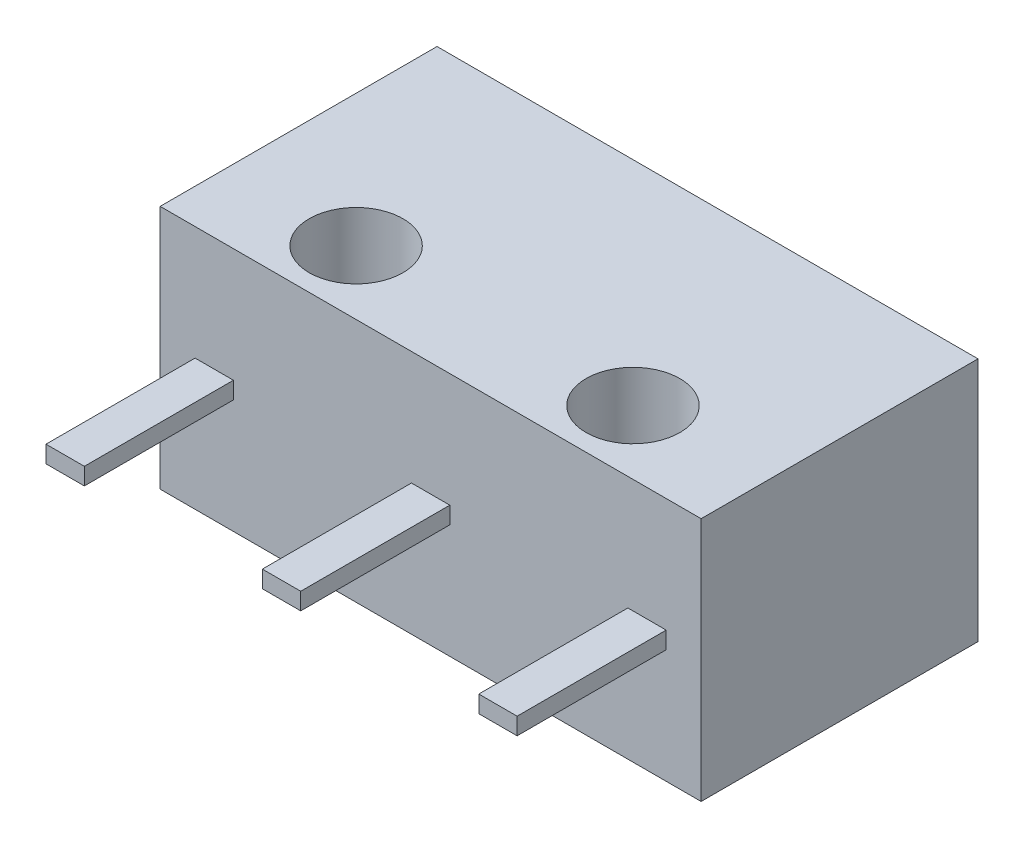
ISO-10303-21;
HEADER;
FILE_DESCRIPTION(('STEP AP214'),'2;1');
FILE_NAME('part.step','',(''),(''),'','','');
FILE_SCHEMA(('AUTOMOTIVE_DESIGN { 1 0 10303 214 1 1 1 1 }'));
ENDSEC;
DATA;
#1=APPLICATION_CONTEXT('core data for automotive mechanical design processes');
#2=APPLICATION_PROTOCOL_DEFINITION('international standard','automotive_design',2000,#1);
#3=PRODUCT_CONTEXT('',#1,'mechanical');
#4=PRODUCT('Part','Part','',(#3));
#5=PRODUCT_RELATED_PRODUCT_CATEGORY('part','',(#4));
#6=PRODUCT_DEFINITION_FORMATION('','',#4);
#7=PRODUCT_DEFINITION_CONTEXT('part definition',#1,'design');
#8=PRODUCT_DEFINITION('design','',#6,#7);
#9=PRODUCT_DEFINITION_SHAPE('','',#8);
#10=(LENGTH_UNIT() NAMED_UNIT(*) SI_UNIT(.MILLI.,.METRE.));
#11=(NAMED_UNIT(*) PLANE_ANGLE_UNIT() SI_UNIT($,.RADIAN.));
#12=(NAMED_UNIT(*) SI_UNIT($,.STERADIAN.) SOLID_ANGLE_UNIT());
#13=UNCERTAINTY_MEASURE_WITH_UNIT(LENGTH_MEASURE(1.E-05),#10,'distance_accuracy_value','');
#14=(GEOMETRIC_REPRESENTATION_CONTEXT(3) GLOBAL_UNCERTAINTY_ASSIGNED_CONTEXT((#13)) GLOBAL_UNIT_ASSIGNED_CONTEXT((#10,
#11,#12)) REPRESENTATION_CONTEXT('',''));
#15=CARTESIAN_POINT('',(0.,0.,0.));
#16=DIRECTION('',(0.,0.,1.));
#17=DIRECTION('',(1.,0.,0.));
#18=AXIS2_PLACEMENT_3D('',#15,#16,#17);
#19=CARTESIAN_POINT('',(5.9,2.675,3.5));
#20=DIRECTION('',(-1.,0.,0.));
#21=DIRECTION('',(0.,0.,1.));
#22=AXIS2_PLACEMENT_3D('',#19,#20,#21);
#23=PLANE('',#22);
#24=DIRECTION('',(0.,1.,0.));
#25=VECTOR('',#24,1.);
#26=CARTESIAN_POINT('',(5.9,2.675,0.));
#27=LINE('',#26,#25);
#28=CARTESIAN_POINT('',(5.9,3.075,0.));
#29=VERTEX_POINT('',#28);
#30=CARTESIAN_POINT('',(5.9,2.675,0.));
#31=VERTEX_POINT('',#30);
#32=EDGE_CURVE('E172',#29,#31,#27,.F.);
#33=ORIENTED_EDGE('',*,*,#32,.T.);
#34=DIRECTION('',(0.,0.,-1.));
#35=VECTOR('',#34,1.);
#36=CARTESIAN_POINT('',(5.9,2.675,0.));
#37=LINE('',#36,#35);
#38=CARTESIAN_POINT('',(5.9,2.675,3.5));
#39=VERTEX_POINT('',#38);
#40=EDGE_CURVE('E233',#39,#31,#37,.T.);
#41=ORIENTED_EDGE('',*,*,#40,.F.);
#42=DIRECTION('',(0.,1.,0.));
#43=VECTOR('',#42,1.);
#44=CARTESIAN_POINT('',(5.9,2.675,3.5));
#45=LINE('',#44,#43);
#46=CARTESIAN_POINT('',(5.9,3.075,3.5));
#47=VERTEX_POINT('',#46);
#48=EDGE_CURVE('E236',#47,#39,#45,.F.);
#49=ORIENTED_EDGE('',*,*,#48,.F.);
#50=DIRECTION('',(0.,0.,-1.));
#51=VECTOR('',#50,1.);
#52=CARTESIAN_POINT('',(5.9,3.075,0.));
#53=LINE('',#52,#51);
#54=EDGE_CURVE('E241',#47,#29,#53,.T.);
#55=ORIENTED_EDGE('',*,*,#54,.T.);
#56=EDGE_LOOP('',(#33,#41,#49,#55));
#57=FACE_BOUND('',#56,.T.);
#58=ADVANCED_FACE('F17',(#57),#23,.T.);
#59=CARTESIAN_POINT('',(10.98,2.675,3.5));
#60=DIRECTION('',(-1.,0.,0.));
#61=DIRECTION('',(0.,0.,1.));
#62=AXIS2_PLACEMENT_3D('',#59,#60,#61);
#63=PLANE('',#62);
#64=DIRECTION('',(0.,1.,0.));
#65=VECTOR('',#64,1.);
#66=CARTESIAN_POINT('',(10.98,2.675,0.));
#67=LINE('',#66,#65);
#68=CARTESIAN_POINT('',(10.98,3.075,0.));
#69=VERTEX_POINT('',#68);
#70=CARTESIAN_POINT('',(10.98,2.675,0.));
#71=VERTEX_POINT('',#70);
#72=EDGE_CURVE('E170',#69,#71,#67,.F.);
#73=ORIENTED_EDGE('',*,*,#72,.T.);
#74=DIRECTION('',(0.,0.,-1.));
#75=VECTOR('',#74,1.);
#76=CARTESIAN_POINT('',(10.98,2.675,0.));
#77=LINE('',#76,#75);
#78=CARTESIAN_POINT('',(10.98,2.675,3.5));
#79=VERTEX_POINT('',#78);
#80=EDGE_CURVE('E212',#79,#71,#77,.T.);
#81=ORIENTED_EDGE('',*,*,#80,.F.);
#82=DIRECTION('',(0.,1.,0.));
#83=VECTOR('',#82,1.);
#84=CARTESIAN_POINT('',(10.98,2.675,3.5));
#85=LINE('',#84,#83);
#86=CARTESIAN_POINT('',(10.98,3.075,3.5));
#87=VERTEX_POINT('',#86);
#88=EDGE_CURVE('E218',#87,#79,#85,.F.);
#89=ORIENTED_EDGE('',*,*,#88,.F.);
#90=DIRECTION('',(0.,0.,-1.));
#91=VECTOR('',#90,1.);
#92=CARTESIAN_POINT('',(10.98,3.075,0.));
#93=LINE('',#92,#91);
#94=EDGE_CURVE('E225',#87,#69,#93,.T.);
#95=ORIENTED_EDGE('',*,*,#94,.T.);
#96=EDGE_LOOP('',(#73,#81,#89,#95));
#97=FACE_BOUND('',#96,.T.);
#98=ADVANCED_FACE('F424',(#97),#63,.T.);
#99=CARTESIAN_POINT('',(0.,3.075,0.));
#100=DIRECTION('',(0.,1.,0.));
#101=DIRECTION('',(0.,0.,1.));
#102=AXIS2_PLACEMENT_3D('',#99,#100,#101);
#103=PLANE('',#102);
#104=DIRECTION('',(0.,0.,-1.));
#105=VECTOR('',#104,1.);
#106=CARTESIAN_POINT('',(1.72,3.075,3.5));
#107=LINE('',#106,#105);
#108=CARTESIAN_POINT('',(1.72,3.075,0.));
#109=VERTEX_POINT('',#108);
#110=CARTESIAN_POINT('',(1.72,3.075,3.5));
#111=VERTEX_POINT('',#110);
#112=EDGE_CURVE('E204',#109,#111,#107,.F.);
#113=ORIENTED_EDGE('',*,*,#112,.F.);
#114=DIRECTION('',(1.,0.,0.));
#115=VECTOR('',#114,1.);
#116=CARTESIAN_POINT('',(0.,3.075,0.));
#117=LINE('',#116,#115);
#118=CARTESIAN_POINT('',(0.820000000000001,3.075,0.));
#119=VERTEX_POINT('',#118);
#120=EDGE_CURVE('E147',#109,#119,#117,.F.);
#121=ORIENTED_EDGE('',*,*,#120,.T.);
#122=DIRECTION('',(0.,0.,1.));
#123=VECTOR('',#122,1.);
#124=CARTESIAN_POINT('',(0.820000000000001,3.075,0.));
#125=LINE('',#124,#123);
#126=CARTESIAN_POINT('',(0.820000000000001,3.075,3.5));
#127=VERTEX_POINT('',#126);
#128=EDGE_CURVE('E196',#127,#119,#125,.F.);
#129=ORIENTED_EDGE('',*,*,#128,.F.);
#130=DIRECTION('',(1.,0.,0.));
#131=VECTOR('',#130,1.);
#132=CARTESIAN_POINT('',(1.27,3.075,3.5));
#133=LINE('',#132,#131);
#134=EDGE_CURVE('E208',#111,#127,#133,.F.);
#135=ORIENTED_EDGE('',*,*,#134,.F.);
#136=EDGE_LOOP('',(#113,#121,#129,#135));
#137=FACE_BOUND('',#136,.T.);
#138=ADVANCED_FACE('F260',(#137),#103,.T.);
#139=CARTESIAN_POINT('',(4.4,4.325,-6.5));
#140=DIRECTION('',(0.,-1.,0.));
#141=DIRECTION('',(0.,0.,-1.));
#142=AXIS2_PLACEMENT_3D('',#139,#140,#141);
#143=PLANE('',#142);
#144=DIRECTION('',(1.,0.,0.));
#145=VECTOR('',#144,1.);
#146=CARTESIAN_POINT('',(4.4,4.325,-6.5));
#147=LINE('',#146,#145);
#148=CARTESIAN_POINT('',(5.,4.325,-6.5));
#149=VERTEX_POINT('',#148);
#150=CARTESIAN_POINT('',(3.8,4.325,-6.5));
#151=VERTEX_POINT('',#150);
#152=EDGE_CURVE('E140',#149,#151,#147,.F.);
#153=ORIENTED_EDGE('',*,*,#152,.F.);
#154=CARTESIAN_POINT('',(4.4,4.325,-6.5));
#155=DIRECTION('',(0.,1.,0.));
#156=DIRECTION('',(0.,0.,1.));
#157=AXIS2_PLACEMENT_3D('',#154,#155,#156);
#158=CIRCLE('',#157,0.6);
#159=EDGE_CURVE('E20',#151,#149,#158,.F.);
#160=ORIENTED_EDGE('',*,*,#159,.F.);
#161=EDGE_LOOP('',(#153,#160));
#162=FACE_BOUND('',#161,.T.);
#163=ADVANCED_FACE('F144',(#162),#143,.F.);
#164=CARTESIAN_POINT('',(4.4,1.425,-6.5));
#165=DIRECTION('',(0.,-1.,0.));
#166=DIRECTION('',(0.,0.,-1.));
#167=AXIS2_PLACEMENT_3D('',#164,#165,#166);
#168=PLANE('',#167);
#169=CARTESIAN_POINT('',(4.4,1.425,-6.5));
#170=DIRECTION('',(0.,1.,0.));
#171=DIRECTION('',(0.,0.,1.));
#172=AXIS2_PLACEMENT_3D('',#169,#170,#171);
#173=CIRCLE('',#172,0.6);
#174=CARTESIAN_POINT('',(5.,1.425,-6.5));
#175=VERTEX_POINT('',#174);
#176=CARTESIAN_POINT('',(3.8,1.425,-6.5));
#177=VERTEX_POINT('',#176);
#178=EDGE_CURVE('E155',#175,#177,#173,.T.);
#179=ORIENTED_EDGE('',*,*,#178,.F.);
#180=DIRECTION('',(1.,0.,0.));
#181=VECTOR('',#180,1.);
#182=CARTESIAN_POINT('',(4.4,1.425,-6.5));
#183=LINE('',#182,#181);
#184=EDGE_CURVE('E146',#175,#177,#183,.F.);
#185=ORIENTED_EDGE('',*,*,#184,.T.);
#186=EDGE_LOOP('',(#179,#185));
#187=FACE_BOUND('',#186,.T.);
#188=ADVANCED_FACE('F248',(#187),#168,.T.);
#189=CARTESIAN_POINT('',(0.,3.075,0.));
#190=DIRECTION('',(0.,-1.,0.));
#191=DIRECTION('',(0.,0.,-1.));
#192=AXIS2_PLACEMENT_3D('',#189,#190,#191);
#193=PLANE('',#192);
#194=DIRECTION('',(1.,0.,0.));
#195=VECTOR('',#194,1.);
#196=CARTESIAN_POINT('',(5.9,3.075,3.5));
#197=LINE('',#196,#195);
#198=CARTESIAN_POINT('',(6.8,3.075,3.5));
#199=VERTEX_POINT('',#198);
#200=EDGE_CURVE('E238',#199,#47,#197,.F.);
#201=ORIENTED_EDGE('',*,*,#200,.F.);
#202=DIRECTION('',(0.,0.,-1.));
#203=VECTOR('',#202,1.);
#204=CARTESIAN_POINT('',(6.8,3.075,3.5));
#205=LINE('',#204,#203);
#206=CARTESIAN_POINT('',(6.8,3.075,0.));
#207=VERTEX_POINT('',#206);
#208=EDGE_CURVE('E184',#207,#199,#205,.F.);
#209=ORIENTED_EDGE('',*,*,#208,.F.);
#210=DIRECTION('',(1.,0.,0.));
#211=VECTOR('',#210,1.);
#212=CARTESIAN_POINT('',(0.,3.075,0.));
#213=LINE('',#212,#211);
#214=EDGE_CURVE('E243',#29,#207,#213,.T.);
#215=ORIENTED_EDGE('',*,*,#214,.F.);
#216=ORIENTED_EDGE('',*,*,#54,.F.);
#217=EDGE_LOOP('',(#201,#209,#215,#216));
#218=FACE_BOUND('',#217,.T.);
#219=ADVANCED_FACE('F250',(#218),#193,.F.);
#220=CARTESIAN_POINT('',(5.9,2.675,3.5));
#221=DIRECTION('',(0.,0.,1.));
#222=DIRECTION('',(1.,0.,0.));
#223=AXIS2_PLACEMENT_3D('',#220,#221,#222);
#224=PLANE('',#223);
#225=ORIENTED_EDGE('',*,*,#48,.T.);
#226=DIRECTION('',(1.,0.,0.));
#227=VECTOR('',#226,1.);
#228=CARTESIAN_POINT('',(0.,2.675,3.5));
#229=LINE('',#228,#227);
#230=CARTESIAN_POINT('',(6.8,2.675,3.5));
#231=VERTEX_POINT('',#230);
#232=EDGE_CURVE('E228',#231,#39,#229,.F.);
#233=ORIENTED_EDGE('',*,*,#232,.F.);
#234=DIRECTION('',(0.,1.,0.));
#235=VECTOR('',#234,1.);
#236=CARTESIAN_POINT('',(6.8,2.675,3.5));
#237=LINE('',#236,#235);
#238=EDGE_CURVE('E185',#199,#231,#237,.F.);
#239=ORIENTED_EDGE('',*,*,#238,.F.);
#240=ORIENTED_EDGE('',*,*,#200,.T.);
#241=EDGE_LOOP('',(#225,#233,#239,#240));
#242=FACE_BOUND('',#241,.T.);
#243=ADVANCED_FACE('F257',(#242),#224,.T.);
#244=CARTESIAN_POINT('',(0.,2.675,0.));
#245=DIRECTION('',(0.,-1.,0.));
#246=DIRECTION('',(0.,0.,-1.));
#247=AXIS2_PLACEMENT_3D('',#244,#245,#246);
#248=PLANE('',#247);
#249=DIRECTION('',(0.,0.,-1.));
#250=VECTOR('',#249,1.);
#251=CARTESIAN_POINT('',(6.8,2.675,3.5));
#252=LINE('',#251,#250);
#253=CARTESIAN_POINT('',(6.8,2.675,0.));
#254=VERTEX_POINT('',#253);
#255=EDGE_CURVE('E191',#231,#254,#252,.T.);
#256=ORIENTED_EDGE('',*,*,#255,.F.);
#257=ORIENTED_EDGE('',*,*,#232,.T.);
#258=ORIENTED_EDGE('',*,*,#40,.T.);
#259=DIRECTION('',(1.,0.,0.));
#260=VECTOR('',#259,1.);
#261=CARTESIAN_POINT('',(0.,2.675,0.));
#262=LINE('',#261,#260);
#263=EDGE_CURVE('E231',#31,#254,#262,.T.);
#264=ORIENTED_EDGE('',*,*,#263,.T.);
#265=EDGE_LOOP('',(#256,#257,#258,#264));
#266=FACE_BOUND('',#265,.T.);
#267=ADVANCED_FACE('F333',(#266),#248,.T.);
#268=CARTESIAN_POINT('',(0.,3.075,0.));
#269=DIRECTION('',(0.,-1.,0.));
#270=DIRECTION('',(0.,0.,-1.));
#271=AXIS2_PLACEMENT_3D('',#268,#269,#270);
#272=PLANE('',#271);
#273=DIRECTION('',(0.,0.,-1.));
#274=VECTOR('',#273,1.);
#275=CARTESIAN_POINT('',(11.88,3.075,0.));
#276=LINE('',#275,#274);
#277=CARTESIAN_POINT('',(11.88,3.075,0.));
#278=VERTEX_POINT('',#277);
#279=CARTESIAN_POINT('',(11.88,3.075,3.5));
#280=VERTEX_POINT('',#279);
#281=EDGE_CURVE('E352',#278,#280,#276,.F.);
#282=ORIENTED_EDGE('',*,*,#281,.F.);
#283=DIRECTION('',(1.,0.,0.));
#284=VECTOR('',#283,1.);
#285=CARTESIAN_POINT('',(0.,3.075,0.));
#286=LINE('',#285,#284);
#287=EDGE_CURVE('E223',#69,#278,#286,.T.);
#288=ORIENTED_EDGE('',*,*,#287,.F.);
#289=ORIENTED_EDGE('',*,*,#94,.F.);
#290=DIRECTION('',(1.,0.,0.));
#291=VECTOR('',#290,1.);
#292=CARTESIAN_POINT('',(11.88,3.075,3.5));
#293=LINE('',#292,#291);
#294=EDGE_CURVE('E220',#280,#87,#293,.F.);
#295=ORIENTED_EDGE('',*,*,#294,.F.);
#296=EDGE_LOOP('',(#282,#288,#289,#295));
#297=FACE_BOUND('',#296,.T.);
#298=ADVANCED_FACE('F329',(#297),#272,.F.);
#299=CARTESIAN_POINT('',(11.88,2.675,3.5));
#300=DIRECTION('',(0.,0.,1.));
#301=DIRECTION('',(1.,0.,0.));
#302=AXIS2_PLACEMENT_3D('',#299,#300,#301);
#303=PLANE('',#302);
#304=ORIENTED_EDGE('',*,*,#88,.T.);
#305=DIRECTION('',(1.,0.,0.));
#306=VECTOR('',#305,1.);
#307=CARTESIAN_POINT('',(0.,2.675,3.5));
#308=LINE('',#307,#306);
#309=CARTESIAN_POINT('',(11.88,2.675,3.5));
#310=VERTEX_POINT('',#309);
#311=EDGE_CURVE('E215',#310,#79,#308,.F.);
#312=ORIENTED_EDGE('',*,*,#311,.F.);
#313=DIRECTION('',(0.,1.,0.));
#314=VECTOR('',#313,1.);
#315=CARTESIAN_POINT('',(11.88,2.675,3.5));
#316=LINE('',#315,#314);
#317=EDGE_CURVE('E353',#280,#310,#316,.F.);
#318=ORIENTED_EDGE('',*,*,#317,.F.);
#319=ORIENTED_EDGE('',*,*,#294,.T.);
#320=EDGE_LOOP('',(#304,#312,#318,#319));
#321=FACE_BOUND('',#320,.T.);
#322=ADVANCED_FACE('F325',(#321),#303,.T.);
#323=CARTESIAN_POINT('',(0.,2.675,0.));
#324=DIRECTION('',(0.,-1.,0.));
#325=DIRECTION('',(0.,0.,-1.));
#326=AXIS2_PLACEMENT_3D('',#323,#324,#325);
#327=PLANE('',#326);
#328=DIRECTION('',(1.,0.,0.));
#329=VECTOR('',#328,1.);
#330=CARTESIAN_POINT('',(0.,2.675,0.));
#331=LINE('',#330,#329);
#332=CARTESIAN_POINT('',(11.88,2.675,0.));
#333=VERTEX_POINT('',#332);
#334=EDGE_CURVE('E210',#71,#333,#331,.T.);
#335=ORIENTED_EDGE('',*,*,#334,.T.);
#336=DIRECTION('',(0.,0.,-1.));
#337=VECTOR('',#336,1.);
#338=CARTESIAN_POINT('',(11.88,2.675,0.));
#339=LINE('',#338,#337);
#340=EDGE_CURVE('E357',#310,#333,#339,.T.);
#341=ORIENTED_EDGE('',*,*,#340,.F.);
#342=ORIENTED_EDGE('',*,*,#311,.T.);
#343=ORIENTED_EDGE('',*,*,#80,.T.);
#344=EDGE_LOOP('',(#335,#341,#342,#343));
#345=FACE_BOUND('',#344,.T.);
#346=ADVANCED_FACE('F321',(#345),#327,.T.);
#347=CARTESIAN_POINT('',(1.27,2.675,3.5));
#348=DIRECTION('',(0.,0.,1.));
#349=DIRECTION('',(1.,0.,0.));
#350=AXIS2_PLACEMENT_3D('',#347,#348,#349);
#351=PLANE('',#350);
#352=DIRECTION('',(0.,1.,0.));
#353=VECTOR('',#352,1.);
#354=CARTESIAN_POINT('',(0.820000000000001,2.675,3.5));
#355=LINE('',#354,#353);
#356=CARTESIAN_POINT('',(0.820000000000001,2.675,3.5));
#357=VERTEX_POINT('',#356);
#358=EDGE_CURVE('E199',#357,#127,#355,.T.);
#359=ORIENTED_EDGE('',*,*,#358,.F.);
#360=DIRECTION('',(1.,0.,0.));
#361=VECTOR('',#360,1.);
#362=CARTESIAN_POINT('',(0.,2.675,3.5));
#363=LINE('',#362,#361);
#364=CARTESIAN_POINT('',(1.72,2.675,3.5));
#365=VERTEX_POINT('',#364);
#366=EDGE_CURVE('E360',#357,#365,#363,.T.);
#367=ORIENTED_EDGE('',*,*,#366,.T.);
#368=DIRECTION('',(0.,1.,0.));
#369=VECTOR('',#368,1.);
#370=CARTESIAN_POINT('',(1.72,2.675,3.5));
#371=LINE('',#370,#369);
#372=EDGE_CURVE('E202',#111,#365,#371,.F.);
#373=ORIENTED_EDGE('',*,*,#372,.F.);
#374=ORIENTED_EDGE('',*,*,#134,.T.);
#375=EDGE_LOOP('',(#359,#367,#373,#374));
#376=FACE_BOUND('',#375,.T.);
#377=ADVANCED_FACE('F317',(#376),#351,.T.);
#378=CARTESIAN_POINT('',(1.72,2.675,3.5));
#379=DIRECTION('',(1.,0.,0.));
#380=DIRECTION('',(0.,0.,-1.));
#381=AXIS2_PLACEMENT_3D('',#378,#379,#380);
#382=PLANE('',#381);
#383=ORIENTED_EDGE('',*,*,#372,.T.);
#384=DIRECTION('',(0.,0.,1.));
#385=VECTOR('',#384,1.);
#386=CARTESIAN_POINT('',(1.72,2.675,0.));
#387=LINE('',#386,#385);
#388=CARTESIAN_POINT('',(1.72,2.675,0.));
#389=VERTEX_POINT('',#388);
#390=EDGE_CURVE('E363',#365,#389,#387,.F.);
#391=ORIENTED_EDGE('',*,*,#390,.T.);
#392=DIRECTION('',(0.,1.,0.));
#393=VECTOR('',#392,1.);
#394=CARTESIAN_POINT('',(1.72,2.675,0.));
#395=LINE('',#394,#393);
#396=EDGE_CURVE('E206',#389,#109,#395,.T.);
#397=ORIENTED_EDGE('',*,*,#396,.T.);
#398=ORIENTED_EDGE('',*,*,#112,.T.);
#399=EDGE_LOOP('',(#383,#391,#397,#398));
#400=FACE_BOUND('',#399,.T.);
#401=ADVANCED_FACE('F313',(#400),#382,.T.);
#402=CARTESIAN_POINT('',(0.820000000000001,2.675,0.));
#403=DIRECTION('',(-1.,0.,0.));
#404=DIRECTION('',(0.,0.,1.));
#405=AXIS2_PLACEMENT_3D('',#402,#403,#404);
#406=PLANE('',#405);
#407=DIRECTION('',(0.,1.,0.));
#408=VECTOR('',#407,1.);
#409=CARTESIAN_POINT('',(0.820000000000001,2.675,0.));
#410=LINE('',#409,#408);
#411=CARTESIAN_POINT('',(0.820000000000001,2.675,0.));
#412=VERTEX_POINT('',#411);
#413=EDGE_CURVE('E156',#119,#412,#410,.F.);
#414=ORIENTED_EDGE('',*,*,#413,.T.);
#415=DIRECTION('',(0.,0.,1.));
#416=VECTOR('',#415,1.);
#417=CARTESIAN_POINT('',(0.820000000000001,2.675,0.));
#418=LINE('',#417,#416);
#419=EDGE_CURVE('E183',#412,#357,#418,.T.);
#420=ORIENTED_EDGE('',*,*,#419,.T.);
#421=ORIENTED_EDGE('',*,*,#358,.T.);
#422=ORIENTED_EDGE('',*,*,#128,.T.);
#423=EDGE_LOOP('',(#414,#420,#421,#422));
#424=FACE_BOUND('',#423,.T.);
#425=ADVANCED_FACE('F310',(#424),#406,.T.);
#426=CARTESIAN_POINT('',(4.4,1.425,-6.5));
#427=DIRECTION('',(0.,1.,0.));
#428=DIRECTION('',(0.,0.,1.));
#429=AXIS2_PLACEMENT_3D('',#426,#427,#428);
#430=CYLINDRICAL_SURFACE('',#429,0.6);
#431=DIRECTION('',(0.,1.,0.));
#432=VECTOR('',#431,1.);
#433=CARTESIAN_POINT('',(5.,5.75,-6.5));
#434=LINE('',#433,#432);
#435=EDGE_CURVE('E153',#149,#175,#434,.F.);
#436=ORIENTED_EDGE('',*,*,#435,.T.);
#437=ORIENTED_EDGE('',*,*,#178,.T.);
#438=DIRECTION('',(0.,1.,0.));
#439=VECTOR('',#438,1.);
#440=CARTESIAN_POINT('',(3.8,5.75,-6.5));
#441=LINE('',#440,#439);
#442=EDGE_CURVE('E154',#177,#151,#441,.T.);
#443=ORIENTED_EDGE('',*,*,#442,.T.);
#444=ORIENTED_EDGE('',*,*,#159,.T.);
#445=EDGE_LOOP('',(#436,#437,#443,#444));
#446=FACE_BOUND('',#445,.T.);
#447=ADVANCED_FACE('F151',(#446),#430,.T.);
#448=CARTESIAN_POINT('',(6.8,2.675,3.5));
#449=DIRECTION('',(1.,0.,0.));
#450=DIRECTION('',(0.,0.,-1.));
#451=AXIS2_PLACEMENT_3D('',#448,#449,#450);
#452=PLANE('',#451);
#453=ORIENTED_EDGE('',*,*,#238,.T.);
#454=ORIENTED_EDGE('',*,*,#255,.T.);
#455=DIRECTION('',(0.,1.,0.));
#456=VECTOR('',#455,1.);
#457=CARTESIAN_POINT('',(6.8,5.75,0.));
#458=LINE('',#457,#456);
#459=EDGE_CURVE('E351',#254,#207,#458,.T.);
#460=ORIENTED_EDGE('',*,*,#459,.T.);
#461=ORIENTED_EDGE('',*,*,#208,.T.);
#462=EDGE_LOOP('',(#453,#454,#460,#461));
#463=FACE_BOUND('',#462,.T.);
#464=ADVANCED_FACE('F304',(#463),#452,.T.);
#465=CARTESIAN_POINT('',(11.88,2.675,0.));
#466=DIRECTION('',(1.,0.,0.));
#467=DIRECTION('',(0.,0.,-1.));
#468=AXIS2_PLACEMENT_3D('',#465,#466,#467);
#469=PLANE('',#468);
#470=ORIENTED_EDGE('',*,*,#317,.T.);
#471=ORIENTED_EDGE('',*,*,#340,.T.);
#472=DIRECTION('',(0.,1.,0.));
#473=VECTOR('',#472,1.);
#474=CARTESIAN_POINT('',(11.88,5.75,0.));
#475=LINE('',#474,#473);
#476=EDGE_CURVE('E380',#333,#278,#475,.T.);
#477=ORIENTED_EDGE('',*,*,#476,.T.);
#478=ORIENTED_EDGE('',*,*,#281,.T.);
#479=EDGE_LOOP('',(#470,#471,#477,#478));
#480=FACE_BOUND('',#479,.T.);
#481=ADVANCED_FACE('F300',(#480),#469,.T.);
#482=CARTESIAN_POINT('',(0.,2.675,0.));
#483=DIRECTION('',(0.,1.,0.));
#484=DIRECTION('',(0.,0.,1.));
#485=AXIS2_PLACEMENT_3D('',#482,#483,#484);
#486=PLANE('',#485);
#487=DIRECTION('',(-1.,0.,0.));
#488=VECTOR('',#487,1.);
#489=CARTESIAN_POINT('',(0.,2.675,0.));
#490=LINE('',#489,#488);
#491=EDGE_CURVE('E383',#412,#389,#490,.F.);
#492=ORIENTED_EDGE('',*,*,#491,.T.);
#493=ORIENTED_EDGE('',*,*,#390,.F.);
#494=ORIENTED_EDGE('',*,*,#366,.F.);
#495=ORIENTED_EDGE('',*,*,#419,.F.);
#496=EDGE_LOOP('',(#492,#493,#494,#495));
#497=FACE_BOUND('',#496,.T.);
#498=ADVANCED_FACE('F296',(#497),#486,.F.);
#499=CARTESIAN_POINT('',(0.,0.,0.));
#500=DIRECTION('',(0.,-1.,0.));
#501=DIRECTION('',(0.,0.,-1.));
#502=AXIS2_PLACEMENT_3D('',#499,#500,#501);
#503=PLANE('',#502);
#504=DIRECTION('',(0.,0.,1.));
#505=VECTOR('',#504,1.);
#506=CARTESIAN_POINT('',(12.7,0.,0.));
#507=LINE('',#506,#505);
#508=CARTESIAN_POINT('',(12.7,0.,-6.5));
#509=VERTEX_POINT('',#508);
#510=CARTESIAN_POINT('',(12.7,0.,0.));
#511=VERTEX_POINT('',#510);
#512=EDGE_CURVE('E372',#509,#511,#507,.T.);
#513=ORIENTED_EDGE('',*,*,#512,.T.);
#514=DIRECTION('',(-1.,0.,0.));
#515=VECTOR('',#514,1.);
#516=CARTESIAN_POINT('',(0.,0.,0.));
#517=LINE('',#516,#515);
#518=CARTESIAN_POINT('',(0.,0.,0.));
#519=VERTEX_POINT('',#518);
#520=EDGE_CURVE('E377',#511,#519,#517,.T.);
#521=ORIENTED_EDGE('',*,*,#520,.T.);
#522=DIRECTION('',(0.,0.,-1.));
#523=VECTOR('',#522,1.);
#524=CARTESIAN_POINT('',(0.,0.,0.));
#525=LINE('',#524,#523);
#526=CARTESIAN_POINT('',(0.,0.,-6.5));
#527=VERTEX_POINT('',#526);
#528=EDGE_CURVE('E180',#519,#527,#525,.T.);
#529=ORIENTED_EDGE('',*,*,#528,.T.);
#530=DIRECTION('',(1.,0.,0.));
#531=VECTOR('',#530,1.);
#532=CARTESIAN_POINT('',(0.,0.,-6.5));
#533=LINE('',#532,#531);
#534=EDGE_CURVE('E161',#527,#509,#533,.T.);
#535=ORIENTED_EDGE('',*,*,#534,.T.);
#536=EDGE_LOOP('',(#513,#521,#529,#535));
#537=FACE_BOUND('',#536,.T.);
#538=CARTESIAN_POINT('',(9.6,0.,-1.5));
#539=DIRECTION('',(0.,1.,0.));
#540=DIRECTION('',(0.,0.,1.));
#541=AXIS2_PLACEMENT_3D('',#538,#539,#540);
#542=CIRCLE('',#541,1.1);
#543=CARTESIAN_POINT('',(9.6,0.,-0.4));
#544=VERTEX_POINT('',#543);
#545=EDGE_CURVE('E159',#544,#544,#542,.T.);
#546=ORIENTED_EDGE('',*,*,#545,.T.);
#547=EDGE_LOOP('',(#546));
#548=FACE_BOUND('',#547,.T.);
#549=CARTESIAN_POINT('',(3.1,0.,-1.5));
#550=DIRECTION('',(0.,1.,0.));
#551=DIRECTION('',(0.,0.,1.));
#552=AXIS2_PLACEMENT_3D('',#549,#550,#551);
#553=CIRCLE('',#552,1.1);
#554=CARTESIAN_POINT('',(3.1,0.,-0.4));
#555=VERTEX_POINT('',#554);
#556=EDGE_CURVE('E164',#555,#555,#553,.T.);
#557=ORIENTED_EDGE('',*,*,#556,.T.);
#558=EDGE_LOOP('',(#557));
#559=FACE_BOUND('',#558,.T.);
#560=ADVANCED_FACE('F292',(#537,#548,#559),#503,.T.);
#561=CARTESIAN_POINT('',(3.1,0.,-1.5));
#562=DIRECTION('',(0.,1.,0.));
#563=DIRECTION('',(0.,0.,1.));
#564=AXIS2_PLACEMENT_3D('',#561,#562,#563);
#565=CYLINDRICAL_SURFACE('',#564,1.1);
#566=ORIENTED_EDGE('',*,*,#556,.F.);
#567=EDGE_LOOP('',(#566));
#568=FACE_BOUND('',#567,.T.);
#569=CARTESIAN_POINT('',(3.1,5.75,-1.5));
#570=DIRECTION('',(0.,1.,0.));
#571=DIRECTION('',(0.,0.,1.));
#572=AXIS2_PLACEMENT_3D('',#569,#570,#571);
#573=CIRCLE('',#572,1.1);
#574=CARTESIAN_POINT('',(3.1,5.75,-0.4));
#575=VERTEX_POINT('',#574);
#576=EDGE_CURVE('E178',#575,#575,#573,.T.);
#577=ORIENTED_EDGE('',*,*,#576,.T.);
#578=EDGE_LOOP('',(#577));
#579=FACE_BOUND('',#578,.T.);
#580=ADVANCED_FACE('F288',(#568,#579),#565,.F.);
#581=CARTESIAN_POINT('',(9.6,0.,-1.5));
#582=DIRECTION('',(0.,1.,0.));
#583=DIRECTION('',(0.,0.,1.));
#584=AXIS2_PLACEMENT_3D('',#581,#582,#583);
#585=CYLINDRICAL_SURFACE('',#584,1.1);
#586=ORIENTED_EDGE('',*,*,#545,.F.);
#587=EDGE_LOOP('',(#586));
#588=FACE_BOUND('',#587,.T.);
#589=CARTESIAN_POINT('',(9.6,5.75,-1.5));
#590=DIRECTION('',(0.,1.,0.));
#591=DIRECTION('',(0.,0.,1.));
#592=AXIS2_PLACEMENT_3D('',#589,#590,#591);
#593=CIRCLE('',#592,1.1);
#594=CARTESIAN_POINT('',(9.6,5.75,-0.4));
#595=VERTEX_POINT('',#594);
#596=EDGE_CURVE('E174',#595,#595,#593,.T.);
#597=ORIENTED_EDGE('',*,*,#596,.T.);
#598=EDGE_LOOP('',(#597));
#599=FACE_BOUND('',#598,.T.);
#600=ADVANCED_FACE('F284',(#588,#599),#585,.F.);
#601=CARTESIAN_POINT('',(0.,5.75,-6.5));
#602=DIRECTION('',(0.,0.,1.));
#603=DIRECTION('',(1.,0.,0.));
#604=AXIS2_PLACEMENT_3D('',#601,#602,#603);
#605=PLANE('',#604);
#606=DIRECTION('',(0.,1.,0.));
#607=VECTOR('',#606,1.);
#608=CARTESIAN_POINT('',(0.,5.75,-6.5));
#609=LINE('',#608,#607);
#610=CARTESIAN_POINT('',(0.,5.75,-6.5));
#611=VERTEX_POINT('',#610);
#612=EDGE_CURVE('E386',#527,#611,#609,.T.);
#613=ORIENTED_EDGE('',*,*,#612,.T.);
#614=DIRECTION('',(1.,0.,0.));
#615=VECTOR('',#614,1.);
#616=CARTESIAN_POINT('',(0.,5.75,-6.5));
#617=LINE('',#616,#615);
#618=CARTESIAN_POINT('',(12.7,5.75,-6.5));
#619=VERTEX_POINT('',#618);
#620=EDGE_CURVE('E177',#611,#619,#617,.T.);
#621=ORIENTED_EDGE('',*,*,#620,.T.);
#622=DIRECTION('',(0.,1.,0.));
#623=VECTOR('',#622,1.);
#624=CARTESIAN_POINT('',(12.7,5.75,-6.5));
#625=LINE('',#624,#623);
#626=EDGE_CURVE('E369',#619,#509,#625,.F.);
#627=ORIENTED_EDGE('',*,*,#626,.T.);
#628=ORIENTED_EDGE('',*,*,#534,.F.);
#629=EDGE_LOOP('',(#613,#621,#627,#628));
#630=FACE_BOUND('',#629,.T.);
#631=ORIENTED_EDGE('',*,*,#184,.F.);
#632=ORIENTED_EDGE('',*,*,#435,.F.);
#633=ORIENTED_EDGE('',*,*,#152,.T.);
#634=ORIENTED_EDGE('',*,*,#442,.F.);
#635=EDGE_LOOP('',(#631,#632,#633,#634));
#636=FACE_BOUND('',#635,.T.);
#637=ADVANCED_FACE('F157',(#630,#636),#605,.F.);
#638=CARTESIAN_POINT('',(12.7,5.75,0.));
#639=DIRECTION('',(-1.,0.,0.));
#640=DIRECTION('',(0.,0.,1.));
#641=AXIS2_PLACEMENT_3D('',#638,#639,#640);
#642=PLANE('',#641);
#643=ORIENTED_EDGE('',*,*,#626,.F.);
#644=DIRECTION('',(0.,0.,-1.));
#645=VECTOR('',#644,1.);
#646=CARTESIAN_POINT('',(12.7,5.75,0.));
#647=LINE('',#646,#645);
#648=CARTESIAN_POINT('',(12.7,5.75,0.));
#649=VERTEX_POINT('',#648);
#650=EDGE_CURVE('E394',#619,#649,#647,.F.);
#651=ORIENTED_EDGE('',*,*,#650,.T.);
#652=DIRECTION('',(0.,1.,0.));
#653=VECTOR('',#652,1.);
#654=CARTESIAN_POINT('',(12.7,5.75,0.));
#655=LINE('',#654,#653);
#656=EDGE_CURVE('E374',#649,#511,#655,.F.);
#657=ORIENTED_EDGE('',*,*,#656,.T.);
#658=ORIENTED_EDGE('',*,*,#512,.F.);
#659=EDGE_LOOP('',(#643,#651,#657,#658));
#660=FACE_BOUND('',#659,.T.);
#661=ADVANCED_FACE('F277',(#660),#642,.F.);
#662=CARTESIAN_POINT('',(0.,5.75,0.));
#663=DIRECTION('',(0.,0.,-1.));
#664=DIRECTION('',(-1.,0.,0.));
#665=AXIS2_PLACEMENT_3D('',#662,#663,#664);
#666=PLANE('',#665);
#667=ORIENTED_EDGE('',*,*,#413,.F.);
#668=ORIENTED_EDGE('',*,*,#120,.F.);
#669=ORIENTED_EDGE('',*,*,#396,.F.);
#670=ORIENTED_EDGE('',*,*,#491,.F.);
#671=EDGE_LOOP('',(#667,#668,#669,#670));
#672=FACE_BOUND('',#671,.T.);
#673=ORIENTED_EDGE('',*,*,#334,.F.);
#674=ORIENTED_EDGE('',*,*,#72,.F.);
#675=ORIENTED_EDGE('',*,*,#287,.T.);
#676=ORIENTED_EDGE('',*,*,#476,.F.);
#677=EDGE_LOOP('',(#673,#674,#675,#676));
#678=FACE_BOUND('',#677,.T.);
#679=ORIENTED_EDGE('',*,*,#263,.F.);
#680=ORIENTED_EDGE('',*,*,#32,.F.);
#681=ORIENTED_EDGE('',*,*,#214,.T.);
#682=ORIENTED_EDGE('',*,*,#459,.F.);
#683=EDGE_LOOP('',(#679,#680,#681,#682));
#684=FACE_BOUND('',#683,.T.);
#685=ORIENTED_EDGE('',*,*,#656,.F.);
#686=DIRECTION('',(1.,0.,0.));
#687=VECTOR('',#686,1.);
#688=CARTESIAN_POINT('',(0.,5.75,0.));
#689=LINE('',#688,#687);
#690=CARTESIAN_POINT('',(0.,5.75,0.));
#691=VERTEX_POINT('',#690);
#692=EDGE_CURVE('E26',#649,#691,#689,.F.);
#693=ORIENTED_EDGE('',*,*,#692,.T.);
#694=DIRECTION('',(0.,1.,0.));
#695=VECTOR('',#694,1.);
#696=CARTESIAN_POINT('',(0.,5.75,0.));
#697=LINE('',#696,#695);
#698=EDGE_CURVE('E34',#691,#519,#697,.F.);
#699=ORIENTED_EDGE('',*,*,#698,.T.);
#700=ORIENTED_EDGE('',*,*,#520,.F.);
#701=EDGE_LOOP('',(#685,#693,#699,#700));
#702=FACE_BOUND('',#701,.T.);
#703=ADVANCED_FACE('F270',(#672,#678,#684,#702),#666,.F.);
#704=CARTESIAN_POINT('',(0.,5.75,0.));
#705=DIRECTION('',(1.,0.,0.));
#706=DIRECTION('',(0.,0.,-1.));
#707=AXIS2_PLACEMENT_3D('',#704,#705,#706);
#708=PLANE('',#707);
#709=ORIENTED_EDGE('',*,*,#698,.F.);
#710=DIRECTION('',(0.,0.,-1.));
#711=VECTOR('',#710,1.);
#712=CARTESIAN_POINT('',(0.,5.75,0.));
#713=LINE('',#712,#711);
#714=EDGE_CURVE('E11',#691,#611,#713,.T.);
#715=ORIENTED_EDGE('',*,*,#714,.T.);
#716=ORIENTED_EDGE('',*,*,#612,.F.);
#717=ORIENTED_EDGE('',*,*,#528,.F.);
#718=EDGE_LOOP('',(#709,#715,#716,#717));
#719=FACE_BOUND('',#718,.T.);
#720=ADVANCED_FACE('F264',(#719),#708,.F.);
#721=CARTESIAN_POINT('',(0.,5.75,0.));
#722=DIRECTION('',(0.,-1.,0.));
#723=DIRECTION('',(0.,0.,-1.));
#724=AXIS2_PLACEMENT_3D('',#721,#722,#723);
#725=PLANE('',#724);
#726=ORIENTED_EDGE('',*,*,#692,.F.);
#727=ORIENTED_EDGE('',*,*,#650,.F.);
#728=ORIENTED_EDGE('',*,*,#620,.F.);
#729=ORIENTED_EDGE('',*,*,#714,.F.);
#730=EDGE_LOOP('',(#726,#727,#728,#729));
#731=FACE_BOUND('',#730,.T.);
#732=ORIENTED_EDGE('',*,*,#596,.F.);
#733=EDGE_LOOP('',(#732));
#734=FACE_BOUND('',#733,.T.);
#735=ORIENTED_EDGE('',*,*,#576,.F.);
#736=EDGE_LOOP('',(#735));
#737=FACE_BOUND('',#736,.T.);
#738=ADVANCED_FACE('F262',(#731,#734,#737),#725,.F.);
#739=CLOSED_SHELL('',(#58,#98,#138,#163,#188,#219,#243,#267,#298,#322,#346,#377,#401,#425,#447,
#464,#481,#498,#560,#580,#600,#637,#661,#703,#720,#738));
#740=MANIFOLD_SOLID_BREP('B1',#739);
#741=ADVANCED_BREP_SHAPE_REPRESENTATION('',(#18,#740),#14);
#742=SHAPE_DEFINITION_REPRESENTATION(#9,#741);
ENDSEC;
END-ISO-10303-21;
